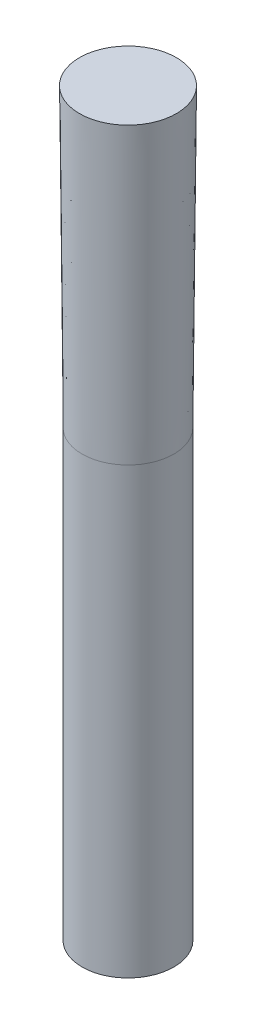
ISO-10303-21;
HEADER;
FILE_DESCRIPTION(('STEP AP214'),'2;1');
FILE_NAME('part.step','',(''),(''),'','','');
FILE_SCHEMA(('AUTOMOTIVE_DESIGN { 1 0 10303 214 1 1 1 1 }'));
ENDSEC;
DATA;
#1=APPLICATION_CONTEXT('core data for automotive mechanical design processes');
#2=APPLICATION_PROTOCOL_DEFINITION('international standard','automotive_design',2000,#1);
#3=PRODUCT_CONTEXT('',#1,'mechanical');
#4=PRODUCT('Part','Part','',(#3));
#5=PRODUCT_RELATED_PRODUCT_CATEGORY('part','',(#4));
#6=PRODUCT_DEFINITION_FORMATION('','',#4);
#7=PRODUCT_DEFINITION_CONTEXT('part definition',#1,'design');
#8=PRODUCT_DEFINITION('design','',#6,#7);
#9=PRODUCT_DEFINITION_SHAPE('','',#8);
#10=(LENGTH_UNIT() NAMED_UNIT(*) SI_UNIT(.MILLI.,.METRE.));
#11=(NAMED_UNIT(*) PLANE_ANGLE_UNIT() SI_UNIT($,.RADIAN.));
#12=(NAMED_UNIT(*) SI_UNIT($,.STERADIAN.) SOLID_ANGLE_UNIT());
#13=UNCERTAINTY_MEASURE_WITH_UNIT(LENGTH_MEASURE(1.E-05),#10,'distance_accuracy_value','');
#14=(GEOMETRIC_REPRESENTATION_CONTEXT(3) GLOBAL_UNCERTAINTY_ASSIGNED_CONTEXT((#13)) GLOBAL_UNIT_ASSIGNED_CONTEXT((#10,
#11,#12)) REPRESENTATION_CONTEXT('',''));
#15=CARTESIAN_POINT('',(0.,0.,0.));
#16=DIRECTION('',(0.,0.,1.));
#17=DIRECTION('',(1.,0.,0.));
#18=AXIS2_PLACEMENT_3D('',#15,#16,#17);
#19=CARTESIAN_POINT('',(0.,30.,0.));
#20=DIRECTION('',(0.,-1.,0.));
#21=DIRECTION('',(0.,0.,-1.));
#22=AXIS2_PLACEMENT_3D('',#19,#20,#21);
#23=CYLINDRICAL_SURFACE('',#22,3.1);
#24=CARTESIAN_POINT('',(0.,30.,0.));
#25=DIRECTION('',(0.,1.,0.));
#26=DIRECTION('',(0.,0.,1.));
#27=AXIS2_PLACEMENT_3D('',#24,#25,#26);
#28=CIRCLE('',#27,3.1);
#29=CARTESIAN_POINT('',(0.,30.,3.1));
#30=VERTEX_POINT('',#29);
#31=EDGE_CURVE('E10',#30,#30,#28,.T.);
#32=ORIENTED_EDGE('',*,*,#31,.F.);
#33=EDGE_LOOP('',(#32));
#34=FACE_BOUND('',#33,.T.);
#35=CARTESIAN_POINT('',(0.,0.,0.));
#36=DIRECTION('',(0.,1.,0.));
#37=DIRECTION('',(0.,0.,1.));
#38=AXIS2_PLACEMENT_3D('',#35,#36,#37);
#39=CIRCLE('',#38,3.1);
#40=CARTESIAN_POINT('',(0.,0.,3.1));
#41=VERTEX_POINT('',#40);
#42=EDGE_CURVE('E36',#41,#41,#39,.T.);
#43=ORIENTED_EDGE('',*,*,#42,.T.);
#44=EDGE_LOOP('',(#43));
#45=FACE_BOUND('',#44,.T.);
#46=ADVANCED_FACE('F33',(#34,#45),#23,.T.);
#47=CARTESIAN_POINT('',(0.,0.,0.));
#48=DIRECTION('',(0.,1.,0.));
#49=DIRECTION('',(0.,0.,1.));
#50=AXIS2_PLACEMENT_3D('',#47,#48,#49);
#51=PLANE('',#50);
#52=ORIENTED_EDGE('',*,*,#42,.F.);
#53=EDGE_LOOP('',(#52));
#54=FACE_BOUND('',#53,.T.);
#55=ADVANCED_FACE('F52',(#54),#51,.F.);
#56=CARTESIAN_POINT('',(0.,30.,0.));
#57=DIRECTION('',(0.,1.,0.));
#58=DIRECTION('',(0.,0.,1.));
#59=AXIS2_PLACEMENT_3D('',#56,#57,#58);
#60=CONICAL_SURFACE('',#59,3.1,0.00872664625997167);
#61=CARTESIAN_POINT('',(0.,50.,0.));
#62=DIRECTION('',(0.,1.,0.));
#63=DIRECTION('',(0.,0.,1.));
#64=AXIS2_PLACEMENT_3D('',#61,#62,#63);
#65=CIRCLE('',#64,3.27453735581518);
#66=CARTESIAN_POINT('',(0.,50.,3.27453735581518));
#67=VERTEX_POINT('',#66);
#68=EDGE_CURVE('E43',#67,#67,#65,.T.);
#69=ORIENTED_EDGE('',*,*,#68,.F.);
#70=EDGE_LOOP('',(#69));
#71=FACE_BOUND('',#70,.T.);
#72=ORIENTED_EDGE('',*,*,#31,.T.);
#73=EDGE_LOOP('',(#72));
#74=FACE_BOUND('',#73,.T.);
#75=ADVANCED_FACE('F50',(#71,#74),#60,.T.);
#76=CARTESIAN_POINT('',(0.,50.,0.));
#77=DIRECTION('',(0.,1.,0.));
#78=DIRECTION('',(0.,0.,1.));
#79=AXIS2_PLACEMENT_3D('',#76,#77,#78);
#80=PLANE('',#79);
#81=ORIENTED_EDGE('',*,*,#68,.T.);
#82=EDGE_LOOP('',(#81));
#83=FACE_BOUND('',#82,.T.);
#84=ADVANCED_FACE('F48',(#83),#80,.T.);
#85=CLOSED_SHELL('',(#46,#55,#75,#84));
#86=MANIFOLD_SOLID_BREP('B2',#85);
#87=ADVANCED_BREP_SHAPE_REPRESENTATION('',(#18,#86),#14);
#88=SHAPE_DEFINITION_REPRESENTATION(#9,#87);
ENDSEC;
END-ISO-10303-21;
